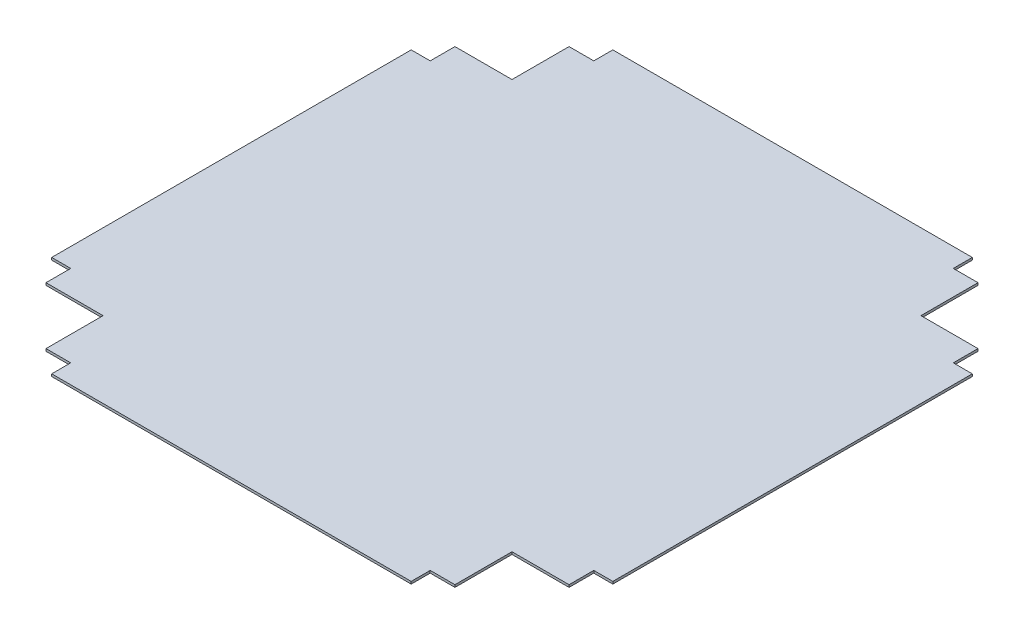
ISO-10303-21;
HEADER;
FILE_DESCRIPTION(('STEP AP214'),'2;1');
FILE_NAME('part.step','',(''),(''),'','','');
FILE_SCHEMA(('AUTOMOTIVE_DESIGN { 1 0 10303 214 1 1 1 1 }'));
ENDSEC;
DATA;
#1=APPLICATION_CONTEXT('core data for automotive mechanical design processes');
#2=APPLICATION_PROTOCOL_DEFINITION('international standard','automotive_design',2000,#1);
#3=PRODUCT_CONTEXT('',#1,'mechanical');
#4=PRODUCT('Part','Part','',(#3));
#5=PRODUCT_RELATED_PRODUCT_CATEGORY('part','',(#4));
#6=PRODUCT_DEFINITION_FORMATION('','',#4);
#7=PRODUCT_DEFINITION_CONTEXT('part definition',#1,'design');
#8=PRODUCT_DEFINITION('design','',#6,#7);
#9=PRODUCT_DEFINITION_SHAPE('','',#8);
#10=(LENGTH_UNIT() NAMED_UNIT(*) SI_UNIT(.MILLI.,.METRE.));
#11=(NAMED_UNIT(*) PLANE_ANGLE_UNIT() SI_UNIT($,.RADIAN.));
#12=(NAMED_UNIT(*) SI_UNIT($,.STERADIAN.) SOLID_ANGLE_UNIT());
#13=UNCERTAINTY_MEASURE_WITH_UNIT(LENGTH_MEASURE(1.E-05),#10,'distance_accuracy_value','');
#14=(GEOMETRIC_REPRESENTATION_CONTEXT(3) GLOBAL_UNCERTAINTY_ASSIGNED_CONTEXT((#13)) GLOBAL_UNIT_ASSIGNED_CONTEXT((#10,
#11,#12)) REPRESENTATION_CONTEXT('',''));
#15=CARTESIAN_POINT('',(0.,0.,0.));
#16=DIRECTION('',(0.,0.,1.));
#17=DIRECTION('',(1.,0.,0.));
#18=AXIS2_PLACEMENT_3D('',#15,#16,#17);
#19=CARTESIAN_POINT('',(374.65,3.175,0.));
#20=DIRECTION('',(1.,0.,0.));
#21=DIRECTION('',(0.,0.,-1.));
#22=AXIS2_PLACEMENT_3D('',#19,#20,#21);
#23=PLANE('',#22);
#24=DIRECTION('',(0.,0.,1.));
#25=VECTOR('',#24,1.);
#26=CARTESIAN_POINT('',(374.65,0.,0.));
#27=LINE('',#26,#25);
#28=CARTESIAN_POINT('',(374.65,0.,-240.03));
#29=VERTEX_POINT('',#28);
#30=CARTESIAN_POINT('',(374.65,0.,240.03));
#31=VERTEX_POINT('',#30);
#32=EDGE_CURVE('E269',#29,#31,#27,.T.);
#33=ORIENTED_EDGE('',*,*,#32,.F.);
#34=DIRECTION('',(0.,-1.,0.));
#35=VECTOR('',#34,1.);
#36=CARTESIAN_POINT('',(374.65,3.175,-240.03));
#37=LINE('',#36,#35);
#38=CARTESIAN_POINT('',(374.65,3.175,-240.03));
#39=VERTEX_POINT('',#38);
#40=EDGE_CURVE('E11',#39,#29,#37,.T.);
#41=ORIENTED_EDGE('',*,*,#40,.F.);
#42=DIRECTION('',(0.,0.,1.));
#43=VECTOR('',#42,1.);
#44=CARTESIAN_POINT('',(374.65,3.175,0.));
#45=LINE('',#44,#43);
#46=CARTESIAN_POINT('',(374.65,3.175,240.03));
#47=VERTEX_POINT('',#46);
#48=EDGE_CURVE('E373',#39,#47,#45,.T.);
#49=ORIENTED_EDGE('',*,*,#48,.T.);
#50=DIRECTION('',(0.,-1.,0.));
#51=VECTOR('',#50,1.);
#52=CARTESIAN_POINT('',(374.65,3.175,240.03));
#53=LINE('',#52,#51);
#54=EDGE_CURVE('E64',#47,#31,#53,.T.);
#55=ORIENTED_EDGE('',*,*,#54,.T.);
#56=EDGE_LOOP('',(#33,#41,#49,#55));
#57=FACE_BOUND('',#56,.T.);
#58=ADVANCED_FACE('F47',(#57),#23,.T.);
#59=CARTESIAN_POINT('',(0.,3.175,-240.03));
#60=DIRECTION('',(0.,0.,1.));
#61=DIRECTION('',(1.,0.,0.));
#62=AXIS2_PLACEMENT_3D('',#59,#60,#61);
#63=PLANE('',#62);
#64=DIRECTION('',(-1.,0.,0.));
#65=VECTOR('',#64,1.);
#66=CARTESIAN_POINT('',(0.,0.,-240.03));
#67=LINE('',#66,#65);
#68=CARTESIAN_POINT('',(349.25,0.,-240.03));
#69=VERTEX_POINT('',#68);
#70=EDGE_CURVE('E272',#29,#69,#67,.T.);
#71=ORIENTED_EDGE('',*,*,#70,.T.);
#72=DIRECTION('',(0.,-1.,0.));
#73=VECTOR('',#72,1.);
#74=CARTESIAN_POINT('',(349.25,3.175,-240.03));
#75=LINE('',#74,#73);
#76=CARTESIAN_POINT('',(349.25,3.175,-240.03));
#77=VERTEX_POINT('',#76);
#78=EDGE_CURVE('E56',#77,#69,#75,.T.);
#79=ORIENTED_EDGE('',*,*,#78,.F.);
#80=DIRECTION('',(-1.,0.,0.));
#81=VECTOR('',#80,1.);
#82=CARTESIAN_POINT('',(0.,3.175,-240.03));
#83=LINE('',#82,#81);
#84=EDGE_CURVE('E475',#39,#77,#83,.T.);
#85=ORIENTED_EDGE('',*,*,#84,.F.);
#86=ORIENTED_EDGE('',*,*,#40,.T.);
#87=EDGE_LOOP('',(#71,#79,#85,#86));
#88=FACE_BOUND('',#87,.T.);
#89=ADVANCED_FACE('F459',(#88),#63,.F.);
#90=CARTESIAN_POINT('',(349.25,3.175,0.));
#91=DIRECTION('',(1.,0.,0.));
#92=DIRECTION('',(0.,0.,-1.));
#93=AXIS2_PLACEMENT_3D('',#90,#91,#92);
#94=PLANE('',#93);
#95=DIRECTION('',(0.,0.,1.));
#96=VECTOR('',#95,1.);
#97=CARTESIAN_POINT('',(349.25,0.,0.));
#98=LINE('',#97,#96);
#99=CARTESIAN_POINT('',(349.25,0.,-273.05));
#100=VERTEX_POINT('',#99);
#101=EDGE_CURVE('E276',#100,#69,#98,.T.);
#102=ORIENTED_EDGE('',*,*,#101,.F.);
#103=DIRECTION('',(0.,-1.,0.));
#104=VECTOR('',#103,1.);
#105=CARTESIAN_POINT('',(349.25,3.175,-273.05));
#106=LINE('',#105,#104);
#107=CARTESIAN_POINT('',(349.25,3.175,-273.05));
#108=VERTEX_POINT('',#107);
#109=EDGE_CURVE('E447',#108,#100,#106,.T.);
#110=ORIENTED_EDGE('',*,*,#109,.F.);
#111=DIRECTION('',(0.,0.,1.));
#112=VECTOR('',#111,1.);
#113=CARTESIAN_POINT('',(349.25,3.175,0.));
#114=LINE('',#113,#112);
#115=EDGE_CURVE('E456',#108,#77,#114,.T.);
#116=ORIENTED_EDGE('',*,*,#115,.T.);
#117=ORIENTED_EDGE('',*,*,#78,.T.);
#118=EDGE_LOOP('',(#102,#110,#116,#117));
#119=FACE_BOUND('',#118,.T.);
#120=ADVANCED_FACE('F454',(#119),#94,.T.);
#121=CARTESIAN_POINT('',(0.,3.175,-273.05));
#122=DIRECTION('',(0.,0.,1.));
#123=DIRECTION('',(1.,0.,0.));
#124=AXIS2_PLACEMENT_3D('',#121,#122,#123);
#125=PLANE('',#124);
#126=DIRECTION('',(-1.,0.,0.));
#127=VECTOR('',#126,1.);
#128=CARTESIAN_POINT('',(0.,0.,-273.05));
#129=LINE('',#128,#127);
#130=CARTESIAN_POINT('',(273.05,0.,-273.05));
#131=VERTEX_POINT('',#130);
#132=EDGE_CURVE('E280',#100,#131,#129,.T.);
#133=ORIENTED_EDGE('',*,*,#132,.T.);
#134=DIRECTION('',(0.,-1.,0.));
#135=VECTOR('',#134,1.);
#136=CARTESIAN_POINT('',(273.05,3.175,-273.05));
#137=LINE('',#136,#135);
#138=CARTESIAN_POINT('',(273.05,3.175,-273.05));
#139=VERTEX_POINT('',#138);
#140=EDGE_CURVE('E444',#139,#131,#137,.T.);
#141=ORIENTED_EDGE('',*,*,#140,.F.);
#142=DIRECTION('',(-1.,0.,0.));
#143=VECTOR('',#142,1.);
#144=CARTESIAN_POINT('',(0.,3.175,-273.05));
#145=LINE('',#144,#143);
#146=EDGE_CURVE('E470',#108,#139,#145,.T.);
#147=ORIENTED_EDGE('',*,*,#146,.F.);
#148=ORIENTED_EDGE('',*,*,#109,.T.);
#149=EDGE_LOOP('',(#133,#141,#147,#148));
#150=FACE_BOUND('',#149,.T.);
#151=ADVANCED_FACE('F467',(#150),#125,.F.);
#152=CARTESIAN_POINT('',(273.05,3.175,0.));
#153=DIRECTION('',(1.,0.,0.));
#154=DIRECTION('',(0.,0.,-1.));
#155=AXIS2_PLACEMENT_3D('',#152,#153,#154);
#156=PLANE('',#155);
#157=DIRECTION('',(0.,0.,1.));
#158=VECTOR('',#157,1.);
#159=CARTESIAN_POINT('',(273.05,0.,0.));
#160=LINE('',#159,#158);
#161=CARTESIAN_POINT('',(273.05,0.,-349.25));
#162=VERTEX_POINT('',#161);
#163=EDGE_CURVE('E284',#162,#131,#160,.T.);
#164=ORIENTED_EDGE('',*,*,#163,.F.);
#165=DIRECTION('',(0.,-1.,0.));
#166=VECTOR('',#165,1.);
#167=CARTESIAN_POINT('',(273.05,3.175,-349.25));
#168=LINE('',#167,#166);
#169=CARTESIAN_POINT('',(273.05,3.175,-349.25));
#170=VERTEX_POINT('',#169);
#171=EDGE_CURVE('E441',#170,#162,#168,.T.);
#172=ORIENTED_EDGE('',*,*,#171,.F.);
#173=DIRECTION('',(0.,0.,1.));
#174=VECTOR('',#173,1.);
#175=CARTESIAN_POINT('',(273.05,3.175,0.));
#176=LINE('',#175,#174);
#177=EDGE_CURVE('E473',#170,#139,#176,.T.);
#178=ORIENTED_EDGE('',*,*,#177,.T.);
#179=ORIENTED_EDGE('',*,*,#140,.T.);
#180=EDGE_LOOP('',(#164,#172,#178,#179));
#181=FACE_BOUND('',#180,.T.);
#182=ADVANCED_FACE('F781',(#181),#156,.T.);
#183=CARTESIAN_POINT('',(0.,3.175,-349.25));
#184=DIRECTION('',(0.,0.,1.));
#185=DIRECTION('',(1.,0.,0.));
#186=AXIS2_PLACEMENT_3D('',#183,#184,#185);
#187=PLANE('',#186);
#188=DIRECTION('',(-1.,0.,0.));
#189=VECTOR('',#188,1.);
#190=CARTESIAN_POINT('',(0.,0.,-349.25));
#191=LINE('',#190,#189);
#192=CARTESIAN_POINT('',(240.03,0.,-349.25));
#193=VERTEX_POINT('',#192);
#194=EDGE_CURVE('E288',#162,#193,#191,.T.);
#195=ORIENTED_EDGE('',*,*,#194,.T.);
#196=DIRECTION('',(0.,-1.,0.));
#197=VECTOR('',#196,1.);
#198=CARTESIAN_POINT('',(240.03,3.175,-349.25));
#199=LINE('',#198,#197);
#200=CARTESIAN_POINT('',(240.03,3.175,-349.25));
#201=VERTEX_POINT('',#200);
#202=EDGE_CURVE('E437',#201,#193,#199,.T.);
#203=ORIENTED_EDGE('',*,*,#202,.F.);
#204=DIRECTION('',(-1.,0.,0.));
#205=VECTOR('',#204,1.);
#206=CARTESIAN_POINT('',(0.,3.175,-349.25));
#207=LINE('',#206,#205);
#208=EDGE_CURVE('E484',#170,#201,#207,.T.);
#209=ORIENTED_EDGE('',*,*,#208,.F.);
#210=ORIENTED_EDGE('',*,*,#171,.T.);
#211=EDGE_LOOP('',(#195,#203,#209,#210));
#212=FACE_BOUND('',#211,.T.);
#213=ADVANCED_FACE('F772',(#212),#187,.F.);
#214=CARTESIAN_POINT('',(240.03,3.175,0.));
#215=DIRECTION('',(-1.,0.,0.));
#216=DIRECTION('',(0.,0.,1.));
#217=AXIS2_PLACEMENT_3D('',#214,#215,#216);
#218=PLANE('',#217);
#219=DIRECTION('',(0.,0.,-1.));
#220=VECTOR('',#219,1.);
#221=CARTESIAN_POINT('',(240.03,0.,0.));
#222=LINE('',#221,#220);
#223=CARTESIAN_POINT('',(240.03,0.,-374.65));
#224=VERTEX_POINT('',#223);
#225=EDGE_CURVE('E291',#193,#224,#222,.T.);
#226=ORIENTED_EDGE('',*,*,#225,.T.);
#227=DIRECTION('',(0.,-1.,0.));
#228=VECTOR('',#227,1.);
#229=CARTESIAN_POINT('',(240.03,3.175,-374.65));
#230=LINE('',#229,#228);
#231=CARTESIAN_POINT('',(240.03,3.175,-374.65));
#232=VERTEX_POINT('',#231);
#233=EDGE_CURVE('E434',#232,#224,#230,.T.);
#234=ORIENTED_EDGE('',*,*,#233,.F.);
#235=DIRECTION('',(0.,0.,-1.));
#236=VECTOR('',#235,1.);
#237=CARTESIAN_POINT('',(240.03,3.175,0.));
#238=LINE('',#237,#236);
#239=EDGE_CURVE('E487',#201,#232,#238,.T.);
#240=ORIENTED_EDGE('',*,*,#239,.F.);
#241=ORIENTED_EDGE('',*,*,#202,.T.);
#242=EDGE_LOOP('',(#226,#234,#240,#241));
#243=FACE_BOUND('',#242,.T.);
#244=ADVANCED_FACE('F763',(#243),#218,.F.);
#245=CARTESIAN_POINT('',(0.,3.175,-374.65));
#246=DIRECTION('',(0.,0.,-1.));
#247=DIRECTION('',(-1.,0.,0.));
#248=AXIS2_PLACEMENT_3D('',#245,#246,#247);
#249=PLANE('',#248);
#250=DIRECTION('',(1.,0.,0.));
#251=VECTOR('',#250,1.);
#252=CARTESIAN_POINT('',(0.,0.,-374.65));
#253=LINE('',#252,#251);
#254=CARTESIAN_POINT('',(-240.03,0.,-374.65));
#255=VERTEX_POINT('',#254);
#256=EDGE_CURVE('E295',#255,#224,#253,.T.);
#257=ORIENTED_EDGE('',*,*,#256,.F.);
#258=DIRECTION('',(0.,-1.,0.));
#259=VECTOR('',#258,1.);
#260=CARTESIAN_POINT('',(-240.03,3.175,-374.65));
#261=LINE('',#260,#259);
#262=CARTESIAN_POINT('',(-240.03,3.175,-374.65));
#263=VERTEX_POINT('',#262);
#264=EDGE_CURVE('E431',#263,#255,#261,.T.);
#265=ORIENTED_EDGE('',*,*,#264,.F.);
#266=DIRECTION('',(1.,0.,0.));
#267=VECTOR('',#266,1.);
#268=CARTESIAN_POINT('',(0.,3.175,-374.65));
#269=LINE('',#268,#267);
#270=EDGE_CURVE('E490',#263,#232,#269,.T.);
#271=ORIENTED_EDGE('',*,*,#270,.T.);
#272=ORIENTED_EDGE('',*,*,#233,.T.);
#273=EDGE_LOOP('',(#257,#265,#271,#272));
#274=FACE_BOUND('',#273,.T.);
#275=ADVANCED_FACE('F754',(#274),#249,.T.);
#276=CARTESIAN_POINT('',(-240.03,3.175,0.));
#277=DIRECTION('',(-1.,0.,0.));
#278=DIRECTION('',(0.,0.,1.));
#279=AXIS2_PLACEMENT_3D('',#276,#277,#278);
#280=PLANE('',#279);
#281=DIRECTION('',(0.,0.,-1.));
#282=VECTOR('',#281,1.);
#283=CARTESIAN_POINT('',(-240.03,0.,0.));
#284=LINE('',#283,#282);
#285=CARTESIAN_POINT('',(-240.03,0.,-349.25));
#286=VERTEX_POINT('',#285);
#287=EDGE_CURVE('E299',#286,#255,#284,.T.);
#288=ORIENTED_EDGE('',*,*,#287,.F.);
#289=DIRECTION('',(0.,-1.,0.));
#290=VECTOR('',#289,1.);
#291=CARTESIAN_POINT('',(-240.03,3.175,-349.25));
#292=LINE('',#291,#290);
#293=CARTESIAN_POINT('',(-240.03,3.175,-349.25));
#294=VERTEX_POINT('',#293);
#295=EDGE_CURVE('E428',#294,#286,#292,.T.);
#296=ORIENTED_EDGE('',*,*,#295,.F.);
#297=DIRECTION('',(0.,0.,-1.));
#298=VECTOR('',#297,1.);
#299=CARTESIAN_POINT('',(-240.03,3.175,0.));
#300=LINE('',#299,#298);
#301=EDGE_CURVE('E494',#294,#263,#300,.T.);
#302=ORIENTED_EDGE('',*,*,#301,.T.);
#303=ORIENTED_EDGE('',*,*,#264,.T.);
#304=EDGE_LOOP('',(#288,#296,#302,#303));
#305=FACE_BOUND('',#304,.T.);
#306=ADVANCED_FACE('F745',(#305),#280,.T.);
#307=CARTESIAN_POINT('',(0.,3.175,-349.25));
#308=DIRECTION('',(0.,0.,-1.));
#309=DIRECTION('',(-1.,0.,0.));
#310=AXIS2_PLACEMENT_3D('',#307,#308,#309);
#311=PLANE('',#310);
#312=DIRECTION('',(1.,0.,0.));
#313=VECTOR('',#312,1.);
#314=CARTESIAN_POINT('',(0.,0.,-349.25));
#315=LINE('',#314,#313);
#316=CARTESIAN_POINT('',(-273.05,0.,-349.25));
#317=VERTEX_POINT('',#316);
#318=EDGE_CURVE('E303',#317,#286,#315,.T.);
#319=ORIENTED_EDGE('',*,*,#318,.F.);
#320=DIRECTION('',(0.,-1.,0.));
#321=VECTOR('',#320,1.);
#322=CARTESIAN_POINT('',(-273.05,3.175,-349.25));
#323=LINE('',#322,#321);
#324=CARTESIAN_POINT('',(-273.05,3.175,-349.25));
#325=VERTEX_POINT('',#324);
#326=EDGE_CURVE('E425',#325,#317,#323,.T.);
#327=ORIENTED_EDGE('',*,*,#326,.F.);
#328=DIRECTION('',(1.,0.,0.));
#329=VECTOR('',#328,1.);
#330=CARTESIAN_POINT('',(0.,3.175,-349.25));
#331=LINE('',#330,#329);
#332=EDGE_CURVE('E498',#325,#294,#331,.T.);
#333=ORIENTED_EDGE('',*,*,#332,.T.);
#334=ORIENTED_EDGE('',*,*,#295,.T.);
#335=EDGE_LOOP('',(#319,#327,#333,#334));
#336=FACE_BOUND('',#335,.T.);
#337=ADVANCED_FACE('F736',(#336),#311,.T.);
#338=CARTESIAN_POINT('',(-273.05,3.175,0.));
#339=DIRECTION('',(1.,0.,0.));
#340=DIRECTION('',(0.,0.,-1.));
#341=AXIS2_PLACEMENT_3D('',#338,#339,#340);
#342=PLANE('',#341);
#343=DIRECTION('',(0.,0.,1.));
#344=VECTOR('',#343,1.);
#345=CARTESIAN_POINT('',(-273.05,0.,0.));
#346=LINE('',#345,#344);
#347=CARTESIAN_POINT('',(-273.05,0.,-273.05));
#348=VERTEX_POINT('',#347);
#349=EDGE_CURVE('E307',#317,#348,#346,.T.);
#350=ORIENTED_EDGE('',*,*,#349,.T.);
#351=DIRECTION('',(0.,-1.,0.));
#352=VECTOR('',#351,1.);
#353=CARTESIAN_POINT('',(-273.05,3.175,-273.05));
#354=LINE('',#353,#352);
#355=CARTESIAN_POINT('',(-273.05,3.175,-273.05));
#356=VERTEX_POINT('',#355);
#357=EDGE_CURVE('E422',#356,#348,#354,.T.);
#358=ORIENTED_EDGE('',*,*,#357,.F.);
#359=DIRECTION('',(0.,0.,1.));
#360=VECTOR('',#359,1.);
#361=CARTESIAN_POINT('',(-273.05,3.175,0.));
#362=LINE('',#361,#360);
#363=EDGE_CURVE('E502',#325,#356,#362,.T.);
#364=ORIENTED_EDGE('',*,*,#363,.F.);
#365=ORIENTED_EDGE('',*,*,#326,.T.);
#366=EDGE_LOOP('',(#350,#358,#364,#365));
#367=FACE_BOUND('',#366,.T.);
#368=ADVANCED_FACE('F727',(#367),#342,.F.);
#369=CARTESIAN_POINT('',(0.,3.175,-273.05));
#370=DIRECTION('',(0.,0.,-1.));
#371=DIRECTION('',(-1.,0.,0.));
#372=AXIS2_PLACEMENT_3D('',#369,#370,#371);
#373=PLANE('',#372);
#374=DIRECTION('',(1.,0.,0.));
#375=VECTOR('',#374,1.);
#376=CARTESIAN_POINT('',(0.,0.,-273.05));
#377=LINE('',#376,#375);
#378=CARTESIAN_POINT('',(-349.25,0.,-273.05));
#379=VERTEX_POINT('',#378);
#380=EDGE_CURVE('E311',#379,#348,#377,.T.);
#381=ORIENTED_EDGE('',*,*,#380,.F.);
#382=DIRECTION('',(0.,-1.,0.));
#383=VECTOR('',#382,1.);
#384=CARTESIAN_POINT('',(-349.25,3.175,-273.05));
#385=LINE('',#384,#383);
#386=CARTESIAN_POINT('',(-349.25,3.175,-273.05));
#387=VERTEX_POINT('',#386);
#388=EDGE_CURVE('E419',#387,#379,#385,.T.);
#389=ORIENTED_EDGE('',*,*,#388,.F.);
#390=DIRECTION('',(1.,0.,0.));
#391=VECTOR('',#390,1.);
#392=CARTESIAN_POINT('',(0.,3.175,-273.05));
#393=LINE('',#392,#391);
#394=EDGE_CURVE('E505',#387,#356,#393,.T.);
#395=ORIENTED_EDGE('',*,*,#394,.T.);
#396=ORIENTED_EDGE('',*,*,#357,.T.);
#397=EDGE_LOOP('',(#381,#389,#395,#396));
#398=FACE_BOUND('',#397,.T.);
#399=ADVANCED_FACE('F718',(#398),#373,.T.);
#400=CARTESIAN_POINT('',(-349.25,3.175,0.));
#401=DIRECTION('',(1.,0.,0.));
#402=DIRECTION('',(0.,0.,-1.));
#403=AXIS2_PLACEMENT_3D('',#400,#401,#402);
#404=PLANE('',#403);
#405=DIRECTION('',(0.,0.,1.));
#406=VECTOR('',#405,1.);
#407=CARTESIAN_POINT('',(-349.25,0.,0.));
#408=LINE('',#407,#406);
#409=CARTESIAN_POINT('',(-349.25,0.,-240.03));
#410=VERTEX_POINT('',#409);
#411=EDGE_CURVE('E315',#379,#410,#408,.T.);
#412=ORIENTED_EDGE('',*,*,#411,.T.);
#413=DIRECTION('',(0.,-1.,0.));
#414=VECTOR('',#413,1.);
#415=CARTESIAN_POINT('',(-349.25,3.175,-240.03));
#416=LINE('',#415,#414);
#417=CARTESIAN_POINT('',(-349.25,3.175,-240.03));
#418=VERTEX_POINT('',#417);
#419=EDGE_CURVE('E416',#418,#410,#416,.T.);
#420=ORIENTED_EDGE('',*,*,#419,.F.);
#421=DIRECTION('',(0.,0.,1.));
#422=VECTOR('',#421,1.);
#423=CARTESIAN_POINT('',(-349.25,3.175,0.));
#424=LINE('',#423,#422);
#425=EDGE_CURVE('E509',#387,#418,#424,.T.);
#426=ORIENTED_EDGE('',*,*,#425,.F.);
#427=ORIENTED_EDGE('',*,*,#388,.T.);
#428=EDGE_LOOP('',(#412,#420,#426,#427));
#429=FACE_BOUND('',#428,.T.);
#430=ADVANCED_FACE('F709',(#429),#404,.F.);
#431=CARTESIAN_POINT('',(0.,3.175,-240.03));
#432=DIRECTION('',(0.,0.,-1.));
#433=DIRECTION('',(-1.,0.,0.));
#434=AXIS2_PLACEMENT_3D('',#431,#432,#433);
#435=PLANE('',#434);
#436=DIRECTION('',(1.,0.,0.));
#437=VECTOR('',#436,1.);
#438=CARTESIAN_POINT('',(0.,0.,-240.03));
#439=LINE('',#438,#437);
#440=CARTESIAN_POINT('',(-374.65,0.,-240.03));
#441=VERTEX_POINT('',#440);
#442=EDGE_CURVE('E319',#441,#410,#439,.T.);
#443=ORIENTED_EDGE('',*,*,#442,.F.);
#444=DIRECTION('',(0.,-1.,0.));
#445=VECTOR('',#444,1.);
#446=CARTESIAN_POINT('',(-374.65,3.175,-240.03));
#447=LINE('',#446,#445);
#448=CARTESIAN_POINT('',(-374.65,3.175,-240.03));
#449=VERTEX_POINT('',#448);
#450=EDGE_CURVE('E413',#449,#441,#447,.T.);
#451=ORIENTED_EDGE('',*,*,#450,.F.);
#452=DIRECTION('',(1.,0.,0.));
#453=VECTOR('',#452,1.);
#454=CARTESIAN_POINT('',(0.,3.175,-240.03));
#455=LINE('',#454,#453);
#456=EDGE_CURVE('E512',#449,#418,#455,.T.);
#457=ORIENTED_EDGE('',*,*,#456,.T.);
#458=ORIENTED_EDGE('',*,*,#419,.T.);
#459=EDGE_LOOP('',(#443,#451,#457,#458));
#460=FACE_BOUND('',#459,.T.);
#461=ADVANCED_FACE('F700',(#460),#435,.T.);
#462=CARTESIAN_POINT('',(-374.65,3.175,0.));
#463=DIRECTION('',(1.,0.,0.));
#464=DIRECTION('',(0.,0.,-1.));
#465=AXIS2_PLACEMENT_3D('',#462,#463,#464);
#466=PLANE('',#465);
#467=DIRECTION('',(0.,0.,1.));
#468=VECTOR('',#467,1.);
#469=CARTESIAN_POINT('',(-374.65,0.,0.));
#470=LINE('',#469,#468);
#471=CARTESIAN_POINT('',(-374.65,0.,240.03));
#472=VERTEX_POINT('',#471);
#473=EDGE_CURVE('E323',#441,#472,#470,.T.);
#474=ORIENTED_EDGE('',*,*,#473,.T.);
#475=DIRECTION('',(0.,-1.,0.));
#476=VECTOR('',#475,1.);
#477=CARTESIAN_POINT('',(-374.65,3.175,240.03));
#478=LINE('',#477,#476);
#479=CARTESIAN_POINT('',(-374.65,3.175,240.03));
#480=VERTEX_POINT('',#479);
#481=EDGE_CURVE('E409',#480,#472,#478,.T.);
#482=ORIENTED_EDGE('',*,*,#481,.F.);
#483=DIRECTION('',(0.,0.,1.));
#484=VECTOR('',#483,1.);
#485=CARTESIAN_POINT('',(-374.65,3.175,0.));
#486=LINE('',#485,#484);
#487=EDGE_CURVE('E516',#449,#480,#486,.T.);
#488=ORIENTED_EDGE('',*,*,#487,.F.);
#489=ORIENTED_EDGE('',*,*,#450,.T.);
#490=EDGE_LOOP('',(#474,#482,#488,#489));
#491=FACE_BOUND('',#490,.T.);
#492=ADVANCED_FACE('F691',(#491),#466,.F.);
#493=CARTESIAN_POINT('',(0.,3.175,240.03));
#494=DIRECTION('',(0.,0.,-1.));
#495=DIRECTION('',(-1.,0.,0.));
#496=AXIS2_PLACEMENT_3D('',#493,#494,#495);
#497=PLANE('',#496);
#498=DIRECTION('',(1.,0.,0.));
#499=VECTOR('',#498,1.);
#500=CARTESIAN_POINT('',(0.,0.,240.03));
#501=LINE('',#500,#499);
#502=CARTESIAN_POINT('',(-349.25,0.,240.03));
#503=VERTEX_POINT('',#502);
#504=EDGE_CURVE('E326',#472,#503,#501,.T.);
#505=ORIENTED_EDGE('',*,*,#504,.T.);
#506=DIRECTION('',(0.,-1.,0.));
#507=VECTOR('',#506,1.);
#508=CARTESIAN_POINT('',(-349.25,3.175,240.03));
#509=LINE('',#508,#507);
#510=CARTESIAN_POINT('',(-349.25,3.175,240.03));
#511=VERTEX_POINT('',#510);
#512=EDGE_CURVE('E406',#511,#503,#509,.T.);
#513=ORIENTED_EDGE('',*,*,#512,.F.);
#514=DIRECTION('',(1.,0.,0.));
#515=VECTOR('',#514,1.);
#516=CARTESIAN_POINT('',(0.,3.175,240.03));
#517=LINE('',#516,#515);
#518=EDGE_CURVE('E519',#480,#511,#517,.T.);
#519=ORIENTED_EDGE('',*,*,#518,.F.);
#520=ORIENTED_EDGE('',*,*,#481,.T.);
#521=EDGE_LOOP('',(#505,#513,#519,#520));
#522=FACE_BOUND('',#521,.T.);
#523=ADVANCED_FACE('F682',(#522),#497,.F.);
#524=CARTESIAN_POINT('',(-349.25,3.175,0.));
#525=DIRECTION('',(-1.,0.,0.));
#526=DIRECTION('',(0.,0.,1.));
#527=AXIS2_PLACEMENT_3D('',#524,#525,#526);
#528=PLANE('',#527);
#529=DIRECTION('',(0.,0.,-1.));
#530=VECTOR('',#529,1.);
#531=CARTESIAN_POINT('',(-349.25,0.,0.));
#532=LINE('',#531,#530);
#533=CARTESIAN_POINT('',(-349.25,0.,273.05));
#534=VERTEX_POINT('',#533);
#535=EDGE_CURVE('E330',#534,#503,#532,.T.);
#536=ORIENTED_EDGE('',*,*,#535,.F.);
#537=DIRECTION('',(0.,-1.,0.));
#538=VECTOR('',#537,1.);
#539=CARTESIAN_POINT('',(-349.25,3.175,273.05));
#540=LINE('',#539,#538);
#541=CARTESIAN_POINT('',(-349.25,3.175,273.05));
#542=VERTEX_POINT('',#541);
#543=EDGE_CURVE('E403',#542,#534,#540,.T.);
#544=ORIENTED_EDGE('',*,*,#543,.F.);
#545=DIRECTION('',(0.,0.,-1.));
#546=VECTOR('',#545,1.);
#547=CARTESIAN_POINT('',(-349.25,3.175,0.));
#548=LINE('',#547,#546);
#549=EDGE_CURVE('E522',#542,#511,#548,.T.);
#550=ORIENTED_EDGE('',*,*,#549,.T.);
#551=ORIENTED_EDGE('',*,*,#512,.T.);
#552=EDGE_LOOP('',(#536,#544,#550,#551));
#553=FACE_BOUND('',#552,.T.);
#554=ADVANCED_FACE('F673',(#553),#528,.T.);
#555=CARTESIAN_POINT('',(0.,3.175,273.05));
#556=DIRECTION('',(0.,0.,-1.));
#557=DIRECTION('',(-1.,0.,0.));
#558=AXIS2_PLACEMENT_3D('',#555,#556,#557);
#559=PLANE('',#558);
#560=DIRECTION('',(1.,0.,0.));
#561=VECTOR('',#560,1.);
#562=CARTESIAN_POINT('',(0.,0.,273.05));
#563=LINE('',#562,#561);
#564=CARTESIAN_POINT('',(-273.05,0.,273.05));
#565=VERTEX_POINT('',#564);
#566=EDGE_CURVE('E334',#534,#565,#563,.T.);
#567=ORIENTED_EDGE('',*,*,#566,.T.);
#568=DIRECTION('',(0.,-1.,0.));
#569=VECTOR('',#568,1.);
#570=CARTESIAN_POINT('',(-273.05,3.175,273.05));
#571=LINE('',#570,#569);
#572=CARTESIAN_POINT('',(-273.05,3.175,273.05));
#573=VERTEX_POINT('',#572);
#574=EDGE_CURVE('E400',#573,#565,#571,.T.);
#575=ORIENTED_EDGE('',*,*,#574,.F.);
#576=DIRECTION('',(1.,0.,0.));
#577=VECTOR('',#576,1.);
#578=CARTESIAN_POINT('',(0.,3.175,273.05));
#579=LINE('',#578,#577);
#580=EDGE_CURVE('E526',#542,#573,#579,.T.);
#581=ORIENTED_EDGE('',*,*,#580,.F.);
#582=ORIENTED_EDGE('',*,*,#543,.T.);
#583=EDGE_LOOP('',(#567,#575,#581,#582));
#584=FACE_BOUND('',#583,.T.);
#585=ADVANCED_FACE('F664',(#584),#559,.F.);
#586=CARTESIAN_POINT('',(-273.05,3.175,0.));
#587=DIRECTION('',(-1.,0.,0.));
#588=DIRECTION('',(0.,0.,1.));
#589=AXIS2_PLACEMENT_3D('',#586,#587,#588);
#590=PLANE('',#589);
#591=DIRECTION('',(0.,0.,-1.));
#592=VECTOR('',#591,1.);
#593=CARTESIAN_POINT('',(-273.05,0.,0.));
#594=LINE('',#593,#592);
#595=CARTESIAN_POINT('',(-273.05,0.,349.25));
#596=VERTEX_POINT('',#595);
#597=EDGE_CURVE('E338',#596,#565,#594,.T.);
#598=ORIENTED_EDGE('',*,*,#597,.F.);
#599=DIRECTION('',(0.,-1.,0.));
#600=VECTOR('',#599,1.);
#601=CARTESIAN_POINT('',(-273.05,3.175,349.25));
#602=LINE('',#601,#600);
#603=CARTESIAN_POINT('',(-273.05,3.175,349.25));
#604=VERTEX_POINT('',#603);
#605=EDGE_CURVE('E397',#604,#596,#602,.T.);
#606=ORIENTED_EDGE('',*,*,#605,.F.);
#607=DIRECTION('',(0.,0.,-1.));
#608=VECTOR('',#607,1.);
#609=CARTESIAN_POINT('',(-273.05,3.175,0.));
#610=LINE('',#609,#608);
#611=EDGE_CURVE('E529',#604,#573,#610,.T.);
#612=ORIENTED_EDGE('',*,*,#611,.T.);
#613=ORIENTED_EDGE('',*,*,#574,.T.);
#614=EDGE_LOOP('',(#598,#606,#612,#613));
#615=FACE_BOUND('',#614,.T.);
#616=ADVANCED_FACE('F655',(#615),#590,.T.);
#617=CARTESIAN_POINT('',(0.,3.175,349.25));
#618=DIRECTION('',(0.,0.,-1.));
#619=DIRECTION('',(-1.,0.,0.));
#620=AXIS2_PLACEMENT_3D('',#617,#618,#619);
#621=PLANE('',#620);
#622=DIRECTION('',(1.,0.,0.));
#623=VECTOR('',#622,1.);
#624=CARTESIAN_POINT('',(0.,0.,349.25));
#625=LINE('',#624,#623);
#626=CARTESIAN_POINT('',(-240.03,0.,349.25));
#627=VERTEX_POINT('',#626);
#628=EDGE_CURVE('E342',#596,#627,#625,.T.);
#629=ORIENTED_EDGE('',*,*,#628,.T.);
#630=DIRECTION('',(0.,-1.,0.));
#631=VECTOR('',#630,1.);
#632=CARTESIAN_POINT('',(-240.03,3.175,349.25));
#633=LINE('',#632,#631);
#634=CARTESIAN_POINT('',(-240.03,3.175,349.25));
#635=VERTEX_POINT('',#634);
#636=EDGE_CURVE('E393',#635,#627,#633,.T.);
#637=ORIENTED_EDGE('',*,*,#636,.F.);
#638=DIRECTION('',(1.,0.,0.));
#639=VECTOR('',#638,1.);
#640=CARTESIAN_POINT('',(0.,3.175,349.25));
#641=LINE('',#640,#639);
#642=EDGE_CURVE('E533',#604,#635,#641,.T.);
#643=ORIENTED_EDGE('',*,*,#642,.F.);
#644=ORIENTED_EDGE('',*,*,#605,.T.);
#645=EDGE_LOOP('',(#629,#637,#643,#644));
#646=FACE_BOUND('',#645,.T.);
#647=ADVANCED_FACE('F646',(#646),#621,.F.);
#648=CARTESIAN_POINT('',(-240.03,3.175,0.));
#649=DIRECTION('',(1.,0.,0.));
#650=DIRECTION('',(0.,0.,-1.));
#651=AXIS2_PLACEMENT_3D('',#648,#649,#650);
#652=PLANE('',#651);
#653=DIRECTION('',(0.,0.,1.));
#654=VECTOR('',#653,1.);
#655=CARTESIAN_POINT('',(-240.03,0.,0.));
#656=LINE('',#655,#654);
#657=CARTESIAN_POINT('',(-240.03,0.,374.65));
#658=VERTEX_POINT('',#657);
#659=EDGE_CURVE('E345',#627,#658,#656,.T.);
#660=ORIENTED_EDGE('',*,*,#659,.T.);
#661=DIRECTION('',(0.,-1.,0.));
#662=VECTOR('',#661,1.);
#663=CARTESIAN_POINT('',(-240.03,3.175,374.65));
#664=LINE('',#663,#662);
#665=CARTESIAN_POINT('',(-240.03,3.175,374.65));
#666=VERTEX_POINT('',#665);
#667=EDGE_CURVE('E389',#666,#658,#664,.T.);
#668=ORIENTED_EDGE('',*,*,#667,.F.);
#669=DIRECTION('',(0.,0.,1.));
#670=VECTOR('',#669,1.);
#671=CARTESIAN_POINT('',(-240.03,3.175,0.));
#672=LINE('',#671,#670);
#673=EDGE_CURVE('E536',#635,#666,#672,.T.);
#674=ORIENTED_EDGE('',*,*,#673,.F.);
#675=ORIENTED_EDGE('',*,*,#636,.T.);
#676=EDGE_LOOP('',(#660,#668,#674,#675));
#677=FACE_BOUND('',#676,.T.);
#678=ADVANCED_FACE('F637',(#677),#652,.F.);
#679=CARTESIAN_POINT('',(0.,3.175,374.65));
#680=DIRECTION('',(0.,0.,-1.));
#681=DIRECTION('',(-1.,0.,0.));
#682=AXIS2_PLACEMENT_3D('',#679,#680,#681);
#683=PLANE('',#682);
#684=DIRECTION('',(1.,0.,0.));
#685=VECTOR('',#684,1.);
#686=CARTESIAN_POINT('',(0.,0.,374.65));
#687=LINE('',#686,#685);
#688=CARTESIAN_POINT('',(240.03,0.,374.65));
#689=VERTEX_POINT('',#688);
#690=EDGE_CURVE('E348',#658,#689,#687,.T.);
#691=ORIENTED_EDGE('',*,*,#690,.T.);
#692=DIRECTION('',(0.,-1.,0.));
#693=VECTOR('',#692,1.);
#694=CARTESIAN_POINT('',(240.03,3.175,374.65));
#695=LINE('',#694,#693);
#696=CARTESIAN_POINT('',(240.03,3.175,374.65));
#697=VERTEX_POINT('',#696);
#698=EDGE_CURVE('E386',#697,#689,#695,.T.);
#699=ORIENTED_EDGE('',*,*,#698,.F.);
#700=DIRECTION('',(1.,0.,0.));
#701=VECTOR('',#700,1.);
#702=CARTESIAN_POINT('',(0.,3.175,374.65));
#703=LINE('',#702,#701);
#704=EDGE_CURVE('E539',#666,#697,#703,.T.);
#705=ORIENTED_EDGE('',*,*,#704,.F.);
#706=ORIENTED_EDGE('',*,*,#667,.T.);
#707=EDGE_LOOP('',(#691,#699,#705,#706));
#708=FACE_BOUND('',#707,.T.);
#709=ADVANCED_FACE('F629',(#708),#683,.F.);
#710=CARTESIAN_POINT('',(240.03,3.175,0.));
#711=DIRECTION('',(1.,0.,0.));
#712=DIRECTION('',(0.,0.,-1.));
#713=AXIS2_PLACEMENT_3D('',#710,#711,#712);
#714=PLANE('',#713);
#715=DIRECTION('',(0.,0.,1.));
#716=VECTOR('',#715,1.);
#717=CARTESIAN_POINT('',(240.03,0.,0.));
#718=LINE('',#717,#716);
#719=CARTESIAN_POINT('',(240.03,0.,349.25));
#720=VERTEX_POINT('',#719);
#721=EDGE_CURVE('E352',#720,#689,#718,.T.);
#722=ORIENTED_EDGE('',*,*,#721,.F.);
#723=DIRECTION('',(0.,-1.,0.));
#724=VECTOR('',#723,1.);
#725=CARTESIAN_POINT('',(240.03,3.175,349.25));
#726=LINE('',#725,#724);
#727=CARTESIAN_POINT('',(240.03,3.175,349.25));
#728=VERTEX_POINT('',#727);
#729=EDGE_CURVE('E383',#728,#720,#726,.T.);
#730=ORIENTED_EDGE('',*,*,#729,.F.);
#731=DIRECTION('',(0.,0.,1.));
#732=VECTOR('',#731,1.);
#733=CARTESIAN_POINT('',(240.03,3.175,0.));
#734=LINE('',#733,#732);
#735=EDGE_CURVE('E542',#728,#697,#734,.T.);
#736=ORIENTED_EDGE('',*,*,#735,.T.);
#737=ORIENTED_EDGE('',*,*,#698,.T.);
#738=EDGE_LOOP('',(#722,#730,#736,#737));
#739=FACE_BOUND('',#738,.T.);
#740=ADVANCED_FACE('F555',(#739),#714,.T.);
#741=CARTESIAN_POINT('',(0.,3.175,349.25));
#742=DIRECTION('',(0.,0.,1.));
#743=DIRECTION('',(1.,0.,0.));
#744=AXIS2_PLACEMENT_3D('',#741,#742,#743);
#745=PLANE('',#744);
#746=DIRECTION('',(-1.,0.,0.));
#747=VECTOR('',#746,1.);
#748=CARTESIAN_POINT('',(0.,0.,349.25));
#749=LINE('',#748,#747);
#750=CARTESIAN_POINT('',(273.05,0.,349.25));
#751=VERTEX_POINT('',#750);
#752=EDGE_CURVE('E356',#751,#720,#749,.T.);
#753=ORIENTED_EDGE('',*,*,#752,.F.);
#754=DIRECTION('',(0.,-1.,0.));
#755=VECTOR('',#754,1.);
#756=CARTESIAN_POINT('',(273.05,3.175,349.25));
#757=LINE('',#756,#755);
#758=CARTESIAN_POINT('',(273.05,3.175,349.25));
#759=VERTEX_POINT('',#758);
#760=EDGE_CURVE('E380',#759,#751,#757,.T.);
#761=ORIENTED_EDGE('',*,*,#760,.F.);
#762=DIRECTION('',(-1.,0.,0.));
#763=VECTOR('',#762,1.);
#764=CARTESIAN_POINT('',(0.,3.175,349.25));
#765=LINE('',#764,#763);
#766=EDGE_CURVE('E263',#759,#728,#765,.T.);
#767=ORIENTED_EDGE('',*,*,#766,.T.);
#768=ORIENTED_EDGE('',*,*,#729,.T.);
#769=EDGE_LOOP('',(#753,#761,#767,#768));
#770=FACE_BOUND('',#769,.T.);
#771=ADVANCED_FACE('F549',(#770),#745,.T.);
#772=CARTESIAN_POINT('',(273.05,3.175,0.));
#773=DIRECTION('',(-1.,0.,0.));
#774=DIRECTION('',(0.,0.,1.));
#775=AXIS2_PLACEMENT_3D('',#772,#773,#774);
#776=PLANE('',#775);
#777=DIRECTION('',(0.,0.,-1.));
#778=VECTOR('',#777,1.);
#779=CARTESIAN_POINT('',(273.05,0.,0.));
#780=LINE('',#779,#778);
#781=CARTESIAN_POINT('',(273.05,0.,273.05));
#782=VERTEX_POINT('',#781);
#783=EDGE_CURVE('E360',#751,#782,#780,.T.);
#784=ORIENTED_EDGE('',*,*,#783,.T.);
#785=DIRECTION('',(0.,-1.,0.));
#786=VECTOR('',#785,1.);
#787=CARTESIAN_POINT('',(273.05,3.175,273.05));
#788=LINE('',#787,#786);
#789=CARTESIAN_POINT('',(273.05,3.175,273.05));
#790=VERTEX_POINT('',#789);
#791=EDGE_CURVE('E245',#790,#782,#788,.T.);
#792=ORIENTED_EDGE('',*,*,#791,.F.);
#793=DIRECTION('',(0.,0.,-1.));
#794=VECTOR('',#793,1.);
#795=CARTESIAN_POINT('',(273.05,3.175,0.));
#796=LINE('',#795,#794);
#797=EDGE_CURVE('E258',#759,#790,#796,.T.);
#798=ORIENTED_EDGE('',*,*,#797,.F.);
#799=ORIENTED_EDGE('',*,*,#760,.T.);
#800=EDGE_LOOP('',(#784,#792,#798,#799));
#801=FACE_BOUND('',#800,.T.);
#802=ADVANCED_FACE('F559',(#801),#776,.F.);
#803=CARTESIAN_POINT('',(0.,3.175,273.05));
#804=DIRECTION('',(0.,0.,1.));
#805=DIRECTION('',(1.,0.,0.));
#806=AXIS2_PLACEMENT_3D('',#803,#804,#805);
#807=PLANE('',#806);
#808=DIRECTION('',(-1.,0.,0.));
#809=VECTOR('',#808,1.);
#810=CARTESIAN_POINT('',(0.,0.,273.05));
#811=LINE('',#810,#809);
#812=CARTESIAN_POINT('',(349.25,0.,273.05));
#813=VERTEX_POINT('',#812);
#814=EDGE_CURVE('E241',#813,#782,#811,.T.);
#815=ORIENTED_EDGE('',*,*,#814,.F.);
#816=DIRECTION('',(0.,-1.,0.));
#817=VECTOR('',#816,1.);
#818=CARTESIAN_POINT('',(349.25,3.175,273.05));
#819=LINE('',#818,#817);
#820=CARTESIAN_POINT('',(349.25,3.175,273.05));
#821=VERTEX_POINT('',#820);
#822=EDGE_CURVE('E235',#821,#813,#819,.T.);
#823=ORIENTED_EDGE('',*,*,#822,.F.);
#824=DIRECTION('',(-1.,0.,0.));
#825=VECTOR('',#824,1.);
#826=CARTESIAN_POINT('',(0.,3.175,273.05));
#827=LINE('',#826,#825);
#828=EDGE_CURVE('E239',#821,#790,#827,.T.);
#829=ORIENTED_EDGE('',*,*,#828,.T.);
#830=ORIENTED_EDGE('',*,*,#791,.T.);
#831=EDGE_LOOP('',(#815,#823,#829,#830));
#832=FACE_BOUND('',#831,.T.);
#833=ADVANCED_FACE('F237',(#832),#807,.T.);
#834=CARTESIAN_POINT('',(349.25,3.175,0.));
#835=DIRECTION('',(-1.,0.,0.));
#836=DIRECTION('',(0.,0.,1.));
#837=AXIS2_PLACEMENT_3D('',#834,#835,#836);
#838=PLANE('',#837);
#839=DIRECTION('',(0.,0.,-1.));
#840=VECTOR('',#839,1.);
#841=CARTESIAN_POINT('',(349.25,0.,0.));
#842=LINE('',#841,#840);
#843=CARTESIAN_POINT('',(349.25,0.,240.03));
#844=VERTEX_POINT('',#843);
#845=EDGE_CURVE('E366',#813,#844,#842,.T.);
#846=ORIENTED_EDGE('',*,*,#845,.T.);
#847=DIRECTION('',(0.,-1.,0.));
#848=VECTOR('',#847,1.);
#849=CARTESIAN_POINT('',(349.25,3.175,240.03));
#850=LINE('',#849,#848);
#851=CARTESIAN_POINT('',(349.25,3.175,240.03));
#852=VERTEX_POINT('',#851);
#853=EDGE_CURVE('E150',#852,#844,#850,.T.);
#854=ORIENTED_EDGE('',*,*,#853,.F.);
#855=DIRECTION('',(0.,0.,-1.));
#856=VECTOR('',#855,1.);
#857=CARTESIAN_POINT('',(349.25,3.175,0.));
#858=LINE('',#857,#856);
#859=EDGE_CURVE('E247',#821,#852,#858,.T.);
#860=ORIENTED_EDGE('',*,*,#859,.F.);
#861=ORIENTED_EDGE('',*,*,#822,.T.);
#862=EDGE_LOOP('',(#846,#854,#860,#861));
#863=FACE_BOUND('',#862,.T.);
#864=ADVANCED_FACE('F248',(#863),#838,.F.);
#865=CARTESIAN_POINT('',(0.,3.175,240.03));
#866=DIRECTION('',(0.,0.,1.));
#867=DIRECTION('',(1.,0.,0.));
#868=AXIS2_PLACEMENT_3D('',#865,#866,#867);
#869=PLANE('',#868);
#870=DIRECTION('',(-1.,0.,0.));
#871=VECTOR('',#870,1.);
#872=CARTESIAN_POINT('',(0.,0.,240.03));
#873=LINE('',#872,#871);
#874=EDGE_CURVE('E369',#31,#844,#873,.T.);
#875=ORIENTED_EDGE('',*,*,#874,.F.);
#876=ORIENTED_EDGE('',*,*,#54,.F.);
#877=DIRECTION('',(-1.,0.,0.));
#878=VECTOR('',#877,1.);
#879=CARTESIAN_POINT('',(0.,3.175,240.03));
#880=LINE('',#879,#878);
#881=EDGE_CURVE('E252',#47,#852,#880,.T.);
#882=ORIENTED_EDGE('',*,*,#881,.T.);
#883=ORIENTED_EDGE('',*,*,#853,.T.);
#884=EDGE_LOOP('',(#875,#876,#882,#883));
#885=FACE_BOUND('',#884,.T.);
#886=ADVANCED_FACE('F572',(#885),#869,.T.);
#887=CARTESIAN_POINT('',(0.,3.175,0.));
#888=DIRECTION('',(0.,1.,0.));
#889=DIRECTION('',(0.,0.,1.));
#890=AXIS2_PLACEMENT_3D('',#887,#888,#889);
#891=PLANE('',#890);
#892=ORIENTED_EDGE('',*,*,#48,.F.);
#893=ORIENTED_EDGE('',*,*,#84,.T.);
#894=ORIENTED_EDGE('',*,*,#115,.F.);
#895=ORIENTED_EDGE('',*,*,#146,.T.);
#896=ORIENTED_EDGE('',*,*,#177,.F.);
#897=ORIENTED_EDGE('',*,*,#208,.T.);
#898=ORIENTED_EDGE('',*,*,#239,.T.);
#899=ORIENTED_EDGE('',*,*,#270,.F.);
#900=ORIENTED_EDGE('',*,*,#301,.F.);
#901=ORIENTED_EDGE('',*,*,#332,.F.);
#902=ORIENTED_EDGE('',*,*,#363,.T.);
#903=ORIENTED_EDGE('',*,*,#394,.F.);
#904=ORIENTED_EDGE('',*,*,#425,.T.);
#905=ORIENTED_EDGE('',*,*,#456,.F.);
#906=ORIENTED_EDGE('',*,*,#487,.T.);
#907=ORIENTED_EDGE('',*,*,#518,.T.);
#908=ORIENTED_EDGE('',*,*,#549,.F.);
#909=ORIENTED_EDGE('',*,*,#580,.T.);
#910=ORIENTED_EDGE('',*,*,#611,.F.);
#911=ORIENTED_EDGE('',*,*,#642,.T.);
#912=ORIENTED_EDGE('',*,*,#673,.T.);
#913=ORIENTED_EDGE('',*,*,#704,.T.);
#914=ORIENTED_EDGE('',*,*,#735,.F.);
#915=ORIENTED_EDGE('',*,*,#766,.F.);
#916=ORIENTED_EDGE('',*,*,#797,.T.);
#917=ORIENTED_EDGE('',*,*,#828,.F.);
#918=ORIENTED_EDGE('',*,*,#859,.T.);
#919=ORIENTED_EDGE('',*,*,#881,.F.);
#920=EDGE_LOOP('',(#892,#893,#894,#895,#896,#897,#898,#899,#900,#901,#902,#903,#904,#905,#906,
#907,#908,#909,#910,#911,#912,#913,#914,#915,#916,#917,#918,#919));
#921=FACE_BOUND('',#920,.T.);
#922=ADVANCED_FACE('F255',(#921),#891,.T.);
#923=CARTESIAN_POINT('',(0.,0.,0.));
#924=DIRECTION('',(0.,1.,0.));
#925=DIRECTION('',(0.,0.,1.));
#926=AXIS2_PLACEMENT_3D('',#923,#924,#925);
#927=PLANE('',#926);
#928=ORIENTED_EDGE('',*,*,#32,.T.);
#929=ORIENTED_EDGE('',*,*,#874,.T.);
#930=ORIENTED_EDGE('',*,*,#845,.F.);
#931=ORIENTED_EDGE('',*,*,#814,.T.);
#932=ORIENTED_EDGE('',*,*,#783,.F.);
#933=ORIENTED_EDGE('',*,*,#752,.T.);
#934=ORIENTED_EDGE('',*,*,#721,.T.);
#935=ORIENTED_EDGE('',*,*,#690,.F.);
#936=ORIENTED_EDGE('',*,*,#659,.F.);
#937=ORIENTED_EDGE('',*,*,#628,.F.);
#938=ORIENTED_EDGE('',*,*,#597,.T.);
#939=ORIENTED_EDGE('',*,*,#566,.F.);
#940=ORIENTED_EDGE('',*,*,#535,.T.);
#941=ORIENTED_EDGE('',*,*,#504,.F.);
#942=ORIENTED_EDGE('',*,*,#473,.F.);
#943=ORIENTED_EDGE('',*,*,#442,.T.);
#944=ORIENTED_EDGE('',*,*,#411,.F.);
#945=ORIENTED_EDGE('',*,*,#380,.T.);
#946=ORIENTED_EDGE('',*,*,#349,.F.);
#947=ORIENTED_EDGE('',*,*,#318,.T.);
#948=ORIENTED_EDGE('',*,*,#287,.T.);
#949=ORIENTED_EDGE('',*,*,#256,.T.);
#950=ORIENTED_EDGE('',*,*,#225,.F.);
#951=ORIENTED_EDGE('',*,*,#194,.F.);
#952=ORIENTED_EDGE('',*,*,#163,.T.);
#953=ORIENTED_EDGE('',*,*,#132,.F.);
#954=ORIENTED_EDGE('',*,*,#101,.T.);
#955=ORIENTED_EDGE('',*,*,#70,.F.);
#956=EDGE_LOOP('',(#928,#929,#930,#931,#932,#933,#934,#935,#936,#937,#938,#939,#940,#941,#942,
#943,#944,#945,#946,#947,#948,#949,#950,#951,#952,#953,#954,#955));
#957=FACE_BOUND('',#956,.T.);
#958=ADVANCED_FACE('F462',(#957),#927,.F.);
#959=CLOSED_SHELL('',(#58,#89,#120,#151,#182,#213,#244,#275,#306,#337,#368,#399,#430,#461,#492,
#523,#554,#585,#616,#647,#678,#709,#740,#771,#802,#833,#864,#886,#922,#958));
#960=MANIFOLD_SOLID_BREP('B2',#959);
#961=ADVANCED_BREP_SHAPE_REPRESENTATION('',(#18,#960),#14);
#962=SHAPE_DEFINITION_REPRESENTATION(#9,#961);
ENDSEC;
END-ISO-10303-21;
